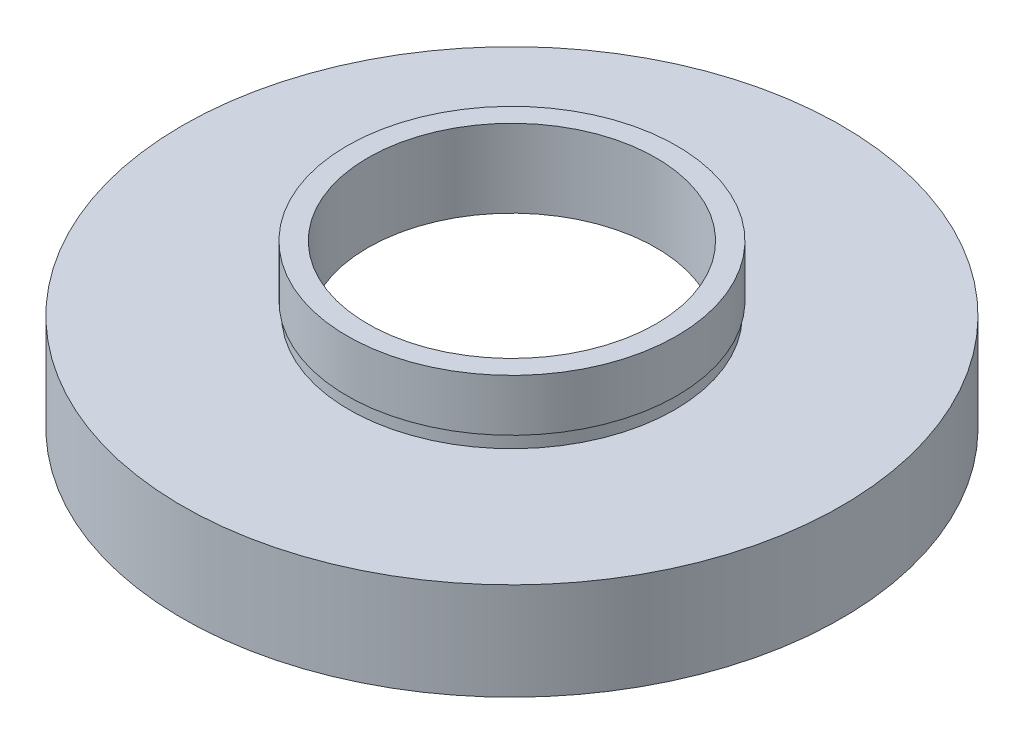
ISO-10303-21;
HEADER;
FILE_DESCRIPTION(('STEP AP214'),'2;1');
FILE_NAME('part.step','',(''),(''),'','','');
FILE_SCHEMA(('AUTOMOTIVE_DESIGN { 1 0 10303 214 1 1 1 1 }'));
ENDSEC;
DATA;
#1=APPLICATION_CONTEXT('core data for automotive mechanical design processes');
#2=APPLICATION_PROTOCOL_DEFINITION('international standard','automotive_design',2000,#1);
#3=PRODUCT_CONTEXT('',#1,'mechanical');
#4=PRODUCT('Part','Part','',(#3));
#5=PRODUCT_RELATED_PRODUCT_CATEGORY('part','',(#4));
#6=PRODUCT_DEFINITION_FORMATION('','',#4);
#7=PRODUCT_DEFINITION_CONTEXT('part definition',#1,'design');
#8=PRODUCT_DEFINITION('design','',#6,#7);
#9=PRODUCT_DEFINITION_SHAPE('','',#8);
#10=(LENGTH_UNIT() NAMED_UNIT(*) SI_UNIT(.MILLI.,.METRE.));
#11=(NAMED_UNIT(*) PLANE_ANGLE_UNIT() SI_UNIT($,.RADIAN.));
#12=(NAMED_UNIT(*) SI_UNIT($,.STERADIAN.) SOLID_ANGLE_UNIT());
#13=UNCERTAINTY_MEASURE_WITH_UNIT(LENGTH_MEASURE(1.E-05),#10,'distance_accuracy_value','');
#14=(GEOMETRIC_REPRESENTATION_CONTEXT(3) GLOBAL_UNCERTAINTY_ASSIGNED_CONTEXT((#13)) GLOBAL_UNIT_ASSIGNED_CONTEXT((#10,
#11,#12)) REPRESENTATION_CONTEXT('',''));
#15=CARTESIAN_POINT('',(0.,0.,0.));
#16=DIRECTION('',(0.,0.,1.));
#17=DIRECTION('',(1.,0.,0.));
#18=AXIS2_PLACEMENT_3D('',#15,#16,#17);
#19=CARTESIAN_POINT('',(25.4,0.,0.));
#20=DIRECTION('',(0.,1.,0.));
#21=DIRECTION('',(-1.,0.,0.));
#22=AXIS2_PLACEMENT_3D('',#19,#20,#21);
#23=PLANE('',#22);
#24=CARTESIAN_POINT('',(0.,0.,0.));
#25=DIRECTION('',(0.,1.,0.));
#26=DIRECTION('',(-1.,0.,0.));
#27=AXIS2_PLACEMENT_3D('',#24,#25,#26);
#28=CIRCLE('',#27,25.4);
#29=CARTESIAN_POINT('',(-25.4,0.,0.));
#30=VERTEX_POINT('',#29);
#31=EDGE_CURVE('E90',#30,#30,#28,.T.);
#32=ORIENTED_EDGE('',*,*,#31,.F.);
#33=EDGE_LOOP('',(#32));
#34=FACE_BOUND('',#33,.T.);
#35=CARTESIAN_POINT('',(0.,0.,0.));
#36=DIRECTION('',(0.,1.,0.));
#37=DIRECTION('',(-1.,0.,0.));
#38=AXIS2_PLACEMENT_3D('',#35,#36,#37);
#39=CIRCLE('',#38,23.5);
#40=CARTESIAN_POINT('',(-23.5,0.,0.));
#41=VERTEX_POINT('',#40);
#42=EDGE_CURVE('E10',#41,#41,#39,.T.);
#43=ORIENTED_EDGE('',*,*,#42,.T.);
#44=EDGE_LOOP('',(#43));
#45=FACE_BOUND('',#44,.T.);
#46=ADVANCED_FACE('F39',(#34,#45),#23,.F.);
#47=CARTESIAN_POINT('',(0.,16.8860182370821,0.));
#48=DIRECTION('',(0.,1.,0.));
#49=DIRECTION('',(-1.,0.,0.));
#50=AXIS2_PLACEMENT_3D('',#47,#48,#49);
#51=CYLINDRICAL_SURFACE('',#50,23.5);
#52=ORIENTED_EDGE('',*,*,#42,.F.);
#53=EDGE_LOOP('',(#52));
#54=FACE_BOUND('',#53,.T.);
#55=CARTESIAN_POINT('',(0.,5.5,0.));
#56=DIRECTION('',(0.,1.,0.));
#57=DIRECTION('',(-1.,0.,0.));
#58=AXIS2_PLACEMENT_3D('',#55,#56,#57);
#59=CIRCLE('',#58,23.5);
#60=CARTESIAN_POINT('',(-23.5,5.49999999999999,0.));
#61=VERTEX_POINT('',#60);
#62=EDGE_CURVE('E46',#61,#61,#59,.T.);
#63=ORIENTED_EDGE('',*,*,#62,.T.);
#64=EDGE_LOOP('',(#63));
#65=FACE_BOUND('',#64,.T.);
#66=ADVANCED_FACE('F98',(#54,#65),#51,.F.);
#67=CARTESIAN_POINT('',(23.5,5.5,0.));
#68=DIRECTION('',(0.,-1.,0.));
#69=DIRECTION('',(1.,0.,0.));
#70=AXIS2_PLACEMENT_3D('',#67,#68,#69);
#71=PLANE('',#70);
#72=ORIENTED_EDGE('',*,*,#62,.F.);
#73=EDGE_LOOP('',(#72));
#74=FACE_BOUND('',#73,.T.);
#75=CARTESIAN_POINT('',(0.,5.49999999999999,0.));
#76=DIRECTION('',(0.,1.,0.));
#77=DIRECTION('',(-1.,0.,0.));
#78=AXIS2_PLACEMENT_3D('',#75,#76,#77);
#79=CIRCLE('',#78,24.1);
#80=CARTESIAN_POINT('',(-24.1,5.49999999999999,0.));
#81=VERTEX_POINT('',#80);
#82=EDGE_CURVE('E53',#81,#81,#79,.T.);
#83=ORIENTED_EDGE('',*,*,#82,.T.);
#84=EDGE_LOOP('',(#83));
#85=FACE_BOUND('',#84,.T.);
#86=ADVANCED_FACE('F102',(#74,#85),#71,.F.);
#87=CARTESIAN_POINT('',(0.,16.8860182370821,0.));
#88=DIRECTION('',(0.,1.,0.));
#89=DIRECTION('',(-1.,0.,0.));
#90=AXIS2_PLACEMENT_3D('',#87,#88,#89);
#91=CYLINDRICAL_SURFACE('',#90,24.1);
#92=ORIENTED_EDGE('',*,*,#82,.F.);
#93=EDGE_LOOP('',(#92));
#94=FACE_BOUND('',#93,.T.);
#95=CARTESIAN_POINT('',(0.,6.5,0.));
#96=DIRECTION('',(0.,1.,0.));
#97=DIRECTION('',(-1.,0.,0.));
#98=AXIS2_PLACEMENT_3D('',#95,#96,#97);
#99=CIRCLE('',#98,24.1);
#100=CARTESIAN_POINT('',(-24.1,6.49999999999999,0.));
#101=VERTEX_POINT('',#100);
#102=EDGE_CURVE('E59',#101,#101,#99,.T.);
#103=ORIENTED_EDGE('',*,*,#102,.T.);
#104=EDGE_LOOP('',(#103));
#105=FACE_BOUND('',#104,.T.);
#106=ADVANCED_FACE('F107',(#94,#105),#91,.F.);
#107=CARTESIAN_POINT('',(11.1,6.5,0.));
#108=DIRECTION('',(0.,1.,0.));
#109=DIRECTION('',(-1.,0.,0.));
#110=AXIS2_PLACEMENT_3D('',#107,#108,#109);
#111=PLANE('',#110);
#112=ORIENTED_EDGE('',*,*,#102,.F.);
#113=EDGE_LOOP('',(#112));
#114=FACE_BOUND('',#113,.T.);
#115=CARTESIAN_POINT('',(0.,6.5,0.));
#116=DIRECTION('',(0.,1.,0.));
#117=DIRECTION('',(-1.,0.,0.));
#118=AXIS2_PLACEMENT_3D('',#115,#116,#117);
#119=CIRCLE('',#118,11.1);
#120=CARTESIAN_POINT('',(-11.1,6.5,0.));
#121=VERTEX_POINT('',#120);
#122=EDGE_CURVE('E65',#121,#121,#119,.T.);
#123=ORIENTED_EDGE('',*,*,#122,.T.);
#124=EDGE_LOOP('',(#123));
#125=FACE_BOUND('',#124,.T.);
#126=ADVANCED_FACE('F113',(#114,#125),#111,.F.);
#127=CARTESIAN_POINT('',(0.,16.8860182370821,0.));
#128=DIRECTION('',(0.,1.,0.));
#129=DIRECTION('',(-1.,0.,0.));
#130=AXIS2_PLACEMENT_3D('',#127,#128,#129);
#131=CYLINDRICAL_SURFACE('',#130,11.1);
#132=ORIENTED_EDGE('',*,*,#122,.F.);
#133=EDGE_LOOP('',(#132));
#134=FACE_BOUND('',#133,.T.);
#135=CARTESIAN_POINT('',(0.,12.5,0.));
#136=DIRECTION('',(0.,1.,0.));
#137=DIRECTION('',(-1.,0.,0.));
#138=AXIS2_PLACEMENT_3D('',#135,#136,#137);
#139=CIRCLE('',#138,11.1);
#140=CARTESIAN_POINT('',(-11.1,12.5,0.));
#141=VERTEX_POINT('',#140);
#142=EDGE_CURVE('E69',#141,#141,#139,.T.);
#143=ORIENTED_EDGE('',*,*,#142,.T.);
#144=EDGE_LOOP('',(#143));
#145=FACE_BOUND('',#144,.T.);
#146=ADVANCED_FACE('F117',(#134,#145),#131,.F.);
#147=CARTESIAN_POINT('',(11.1,12.5,0.));
#148=DIRECTION('',(0.,-1.,0.));
#149=DIRECTION('',(1.,0.,0.));
#150=AXIS2_PLACEMENT_3D('',#147,#148,#149);
#151=PLANE('',#150);
#152=ORIENTED_EDGE('',*,*,#142,.F.);
#153=EDGE_LOOP('',(#152));
#154=FACE_BOUND('',#153,.T.);
#155=CARTESIAN_POINT('',(0.,12.5,0.));
#156=DIRECTION('',(0.,1.,0.));
#157=DIRECTION('',(-1.,0.,0.));
#158=AXIS2_PLACEMENT_3D('',#155,#156,#157);
#159=CIRCLE('',#158,12.7);
#160=CARTESIAN_POINT('',(-12.7,12.5,0.));
#161=VERTEX_POINT('',#160);
#162=EDGE_CURVE('E72',#161,#161,#159,.T.);
#163=ORIENTED_EDGE('',*,*,#162,.T.);
#164=EDGE_LOOP('',(#163));
#165=FACE_BOUND('',#164,.T.);
#166=ADVANCED_FACE('F121',(#154,#165),#151,.F.);
#167=CARTESIAN_POINT('',(0.,16.8860182370821,0.));
#168=DIRECTION('',(0.,1.,0.));
#169=DIRECTION('',(-1.,0.,0.));
#170=AXIS2_PLACEMENT_3D('',#167,#168,#169);
#171=CYLINDRICAL_SURFACE('',#170,12.7);
#172=ORIENTED_EDGE('',*,*,#162,.F.);
#173=EDGE_LOOP('',(#172));
#174=FACE_BOUND('',#173,.T.);
#175=CARTESIAN_POINT('',(0.,8.5,0.));
#176=DIRECTION('',(0.,1.,0.));
#177=DIRECTION('',(-1.,0.,0.));
#178=AXIS2_PLACEMENT_3D('',#175,#176,#177);
#179=CIRCLE('',#178,12.7);
#180=CARTESIAN_POINT('',(-12.7,8.5,0.));
#181=VERTEX_POINT('',#180);
#182=EDGE_CURVE('E75',#181,#181,#179,.T.);
#183=ORIENTED_EDGE('',*,*,#182,.T.);
#184=EDGE_LOOP('',(#183));
#185=FACE_BOUND('',#184,.T.);
#186=ADVANCED_FACE('F125',(#174,#185),#171,.T.);
#187=CARTESIAN_POINT('',(12.7,8.5,0.));
#188=DIRECTION('',(0.,1.,0.));
#189=DIRECTION('',(-1.,0.,0.));
#190=AXIS2_PLACEMENT_3D('',#187,#188,#189);
#191=PLANE('',#190);
#192=ORIENTED_EDGE('',*,*,#182,.F.);
#193=EDGE_LOOP('',(#192));
#194=FACE_BOUND('',#193,.T.);
#195=CARTESIAN_POINT('',(0.,8.5,0.));
#196=DIRECTION('',(0.,1.,0.));
#197=DIRECTION('',(-1.,0.,0.));
#198=AXIS2_PLACEMENT_3D('',#195,#196,#197);
#199=CIRCLE('',#198,12.55);
#200=CARTESIAN_POINT('',(-12.55,8.5,0.));
#201=VERTEX_POINT('',#200);
#202=EDGE_CURVE('E79',#201,#201,#199,.T.);
#203=ORIENTED_EDGE('',*,*,#202,.T.);
#204=EDGE_LOOP('',(#203));
#205=FACE_BOUND('',#204,.T.);
#206=ADVANCED_FACE('F129',(#194,#205),#191,.F.);
#207=CARTESIAN_POINT('',(0.,16.8860182370821,0.));
#208=DIRECTION('',(0.,1.,0.));
#209=DIRECTION('',(-1.,0.,0.));
#210=AXIS2_PLACEMENT_3D('',#207,#208,#209);
#211=CYLINDRICAL_SURFACE('',#210,12.55);
#212=ORIENTED_EDGE('',*,*,#202,.F.);
#213=EDGE_LOOP('',(#212));
#214=FACE_BOUND('',#213,.T.);
#215=CARTESIAN_POINT('',(0.,7.5,0.));
#216=DIRECTION('',(0.,1.,0.));
#217=DIRECTION('',(-1.,0.,0.));
#218=AXIS2_PLACEMENT_3D('',#215,#216,#217);
#219=CIRCLE('',#218,12.55);
#220=CARTESIAN_POINT('',(-12.55,7.5,0.));
#221=VERTEX_POINT('',#220);
#222=EDGE_CURVE('E83',#221,#221,#219,.T.);
#223=ORIENTED_EDGE('',*,*,#222,.T.);
#224=EDGE_LOOP('',(#223));
#225=FACE_BOUND('',#224,.T.);
#226=ADVANCED_FACE('F133',(#214,#225),#211,.T.);
#227=CARTESIAN_POINT('',(12.55,7.5,0.));
#228=DIRECTION('',(0.,-1.,0.));
#229=DIRECTION('',(1.,0.,0.));
#230=AXIS2_PLACEMENT_3D('',#227,#228,#229);
#231=PLANE('',#230);
#232=ORIENTED_EDGE('',*,*,#222,.F.);
#233=EDGE_LOOP('',(#232));
#234=FACE_BOUND('',#233,.T.);
#235=CARTESIAN_POINT('',(0.,7.5,0.));
#236=DIRECTION('',(0.,1.,0.));
#237=DIRECTION('',(-1.,0.,0.));
#238=AXIS2_PLACEMENT_3D('',#235,#236,#237);
#239=CIRCLE('',#238,25.4);
#240=CARTESIAN_POINT('',(-25.4,7.49999999999999,0.));
#241=VERTEX_POINT('',#240);
#242=EDGE_CURVE('E87',#241,#241,#239,.T.);
#243=ORIENTED_EDGE('',*,*,#242,.T.);
#244=EDGE_LOOP('',(#243));
#245=FACE_BOUND('',#244,.T.);
#246=ADVANCED_FACE('F137',(#234,#245),#231,.F.);
#247=CARTESIAN_POINT('',(0.,16.8860182370821,0.));
#248=DIRECTION('',(0.,1.,0.));
#249=DIRECTION('',(-1.,0.,0.));
#250=AXIS2_PLACEMENT_3D('',#247,#248,#249);
#251=CYLINDRICAL_SURFACE('',#250,25.4);
#252=ORIENTED_EDGE('',*,*,#242,.F.);
#253=EDGE_LOOP('',(#252));
#254=FACE_BOUND('',#253,.T.);
#255=ORIENTED_EDGE('',*,*,#31,.T.);
#256=EDGE_LOOP('',(#255));
#257=FACE_BOUND('',#256,.T.);
#258=ADVANCED_FACE('F95',(#254,#257),#251,.T.);
#259=CLOSED_SHELL('',(#46,#66,#86,#106,#126,#146,#166,#186,#206,#226,#246,#258));
#260=MANIFOLD_SOLID_BREP('B2',#259);
#261=ADVANCED_BREP_SHAPE_REPRESENTATION('',(#18,#260),#14);
#262=SHAPE_DEFINITION_REPRESENTATION(#9,#261);
ENDSEC;
END-ISO-10303-21;
